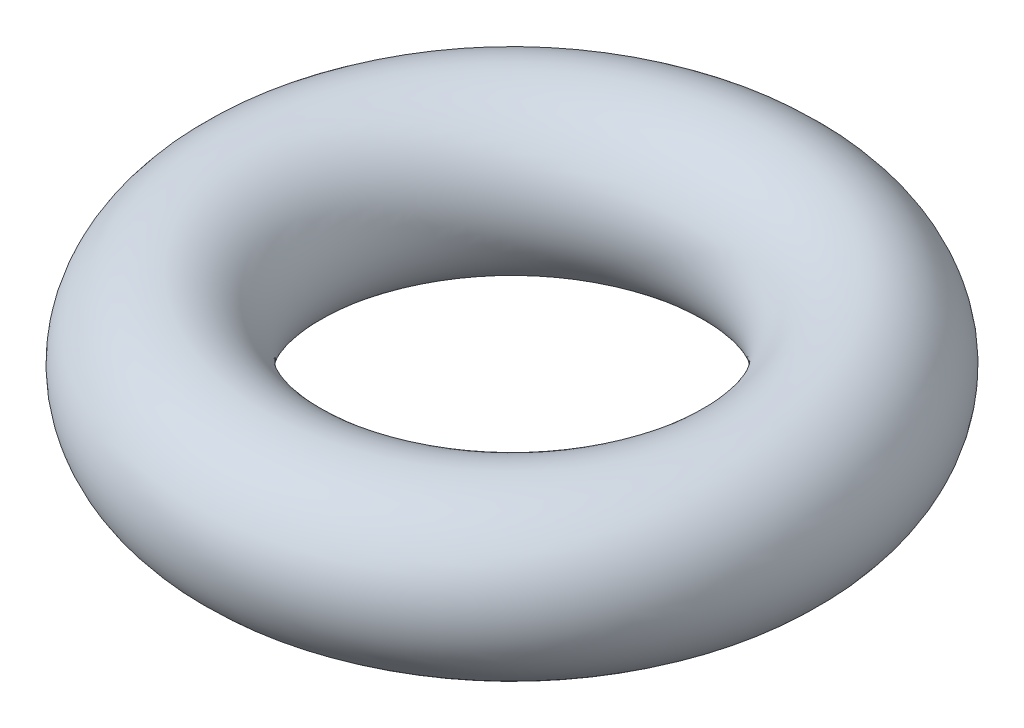
ISO-10303-21;
HEADER;
FILE_DESCRIPTION(('STEP AP214'),'2;1');
FILE_NAME('part.step','',(''),(''),'','','');
FILE_SCHEMA(('AUTOMOTIVE_DESIGN { 1 0 10303 214 1 1 1 1 }'));
ENDSEC;
DATA;
#1=APPLICATION_CONTEXT('core data for automotive mechanical design processes');
#2=APPLICATION_PROTOCOL_DEFINITION('international standard','automotive_design',2000,#1);
#3=PRODUCT_CONTEXT('',#1,'mechanical');
#4=PRODUCT('Part','Part','',(#3));
#5=PRODUCT_RELATED_PRODUCT_CATEGORY('part','',(#4));
#6=PRODUCT_DEFINITION_FORMATION('','',#4);
#7=PRODUCT_DEFINITION_CONTEXT('part definition',#1,'design');
#8=PRODUCT_DEFINITION('design','',#6,#7);
#9=PRODUCT_DEFINITION_SHAPE('','',#8);
#10=(LENGTH_UNIT() NAMED_UNIT(*) SI_UNIT(.MILLI.,.METRE.));
#11=(NAMED_UNIT(*) PLANE_ANGLE_UNIT() SI_UNIT($,.RADIAN.));
#12=(NAMED_UNIT(*) SI_UNIT($,.STERADIAN.) SOLID_ANGLE_UNIT());
#13=UNCERTAINTY_MEASURE_WITH_UNIT(LENGTH_MEASURE(1.E-05),#10,'distance_accuracy_value','');
#14=(GEOMETRIC_REPRESENTATION_CONTEXT(3) GLOBAL_UNCERTAINTY_ASSIGNED_CONTEXT((#13)) GLOBAL_UNIT_ASSIGNED_CONTEXT((#10,
#11,#12)) REPRESENTATION_CONTEXT('',''));
#15=CARTESIAN_POINT('',(0.,0.,0.));
#16=DIRECTION('',(0.,0.,1.));
#17=DIRECTION('',(1.,0.,0.));
#18=AXIS2_PLACEMENT_3D('',#15,#16,#17);
#19=CARTESIAN_POINT('',(0.,0.,0.));
#20=DIRECTION('',(0.,-1.,0.));
#21=DIRECTION('',(0.,0.,-1.));
#22=AXIS2_PLACEMENT_3D('',#19,#20,#21);
#23=TOROIDAL_SURFACE('',#22,2.7305,0.889);
#24=CARTESIAN_POINT('',(0.,0.,-3.6195));
#25=VERTEX_POINT('',#24);
#26=VERTEX_LOOP('',#25);
#27=FACE_BOUND('',#26,.T.);
#28=ADVANCED_FACE('F33',(#27),#23,.T.);
#29=CLOSED_SHELL('',(#28));
#30=MANIFOLD_SOLID_BREP('B2',#29);
#31=ADVANCED_BREP_SHAPE_REPRESENTATION('',(#18,#30),#14);
#32=SHAPE_DEFINITION_REPRESENTATION(#9,#31);
ENDSEC;
END-ISO-10303-21;
